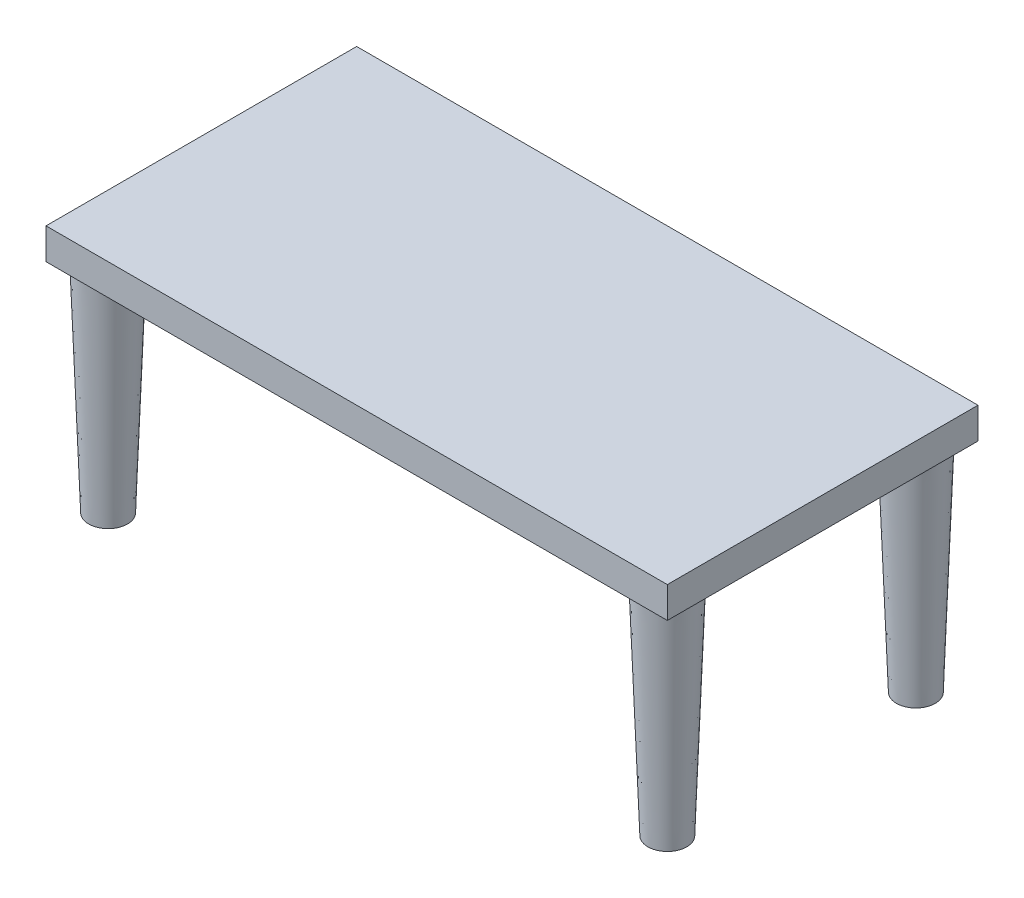
ISO-10303-21;
HEADER;
FILE_DESCRIPTION(('STEP AP214'),'2;1');
FILE_NAME('part.step','',(''),(''),'','','');
FILE_SCHEMA(('AUTOMOTIVE_DESIGN { 1 0 10303 214 1 1 1 1 }'));
ENDSEC;
DATA;
#1=APPLICATION_CONTEXT('core data for automotive mechanical design processes');
#2=APPLICATION_PROTOCOL_DEFINITION('international standard','automotive_design',2000,#1);
#3=PRODUCT_CONTEXT('',#1,'mechanical');
#4=PRODUCT('Part','Part','',(#3));
#5=PRODUCT_RELATED_PRODUCT_CATEGORY('part','',(#4));
#6=PRODUCT_DEFINITION_FORMATION('','',#4);
#7=PRODUCT_DEFINITION_CONTEXT('part definition',#1,'design');
#8=PRODUCT_DEFINITION('design','',#6,#7);
#9=PRODUCT_DEFINITION_SHAPE('','',#8);
#10=(LENGTH_UNIT() NAMED_UNIT(*) SI_UNIT(.MILLI.,.METRE.));
#11=(NAMED_UNIT(*) PLANE_ANGLE_UNIT() SI_UNIT($,.RADIAN.));
#12=(NAMED_UNIT(*) SI_UNIT($,.STERADIAN.) SOLID_ANGLE_UNIT());
#13=UNCERTAINTY_MEASURE_WITH_UNIT(LENGTH_MEASURE(1.E-05),#10,'distance_accuracy_value','');
#14=(GEOMETRIC_REPRESENTATION_CONTEXT(3) GLOBAL_UNCERTAINTY_ASSIGNED_CONTEXT((#13)) GLOBAL_UNIT_ASSIGNED_CONTEXT((#10,
#11,#12)) REPRESENTATION_CONTEXT('',''));
#15=CARTESIAN_POINT('',(0.,0.,0.));
#16=DIRECTION('',(0.,0.,1.));
#17=DIRECTION('',(1.,0.,0.));
#18=AXIS2_PLACEMENT_3D('',#15,#16,#17);
#19=CARTESIAN_POINT('',(100.,5.,-50.));
#20=DIRECTION('',(-1.,0.,0.));
#21=DIRECTION('',(0.,0.,1.));
#22=AXIS2_PLACEMENT_3D('',#19,#20,#21);
#23=PLANE('',#22);
#24=DIRECTION('',(0.,0.,-1.));
#25=VECTOR('',#24,1.);
#26=CARTESIAN_POINT('',(100.,-5.,-50.));
#27=LINE('',#26,#25);
#28=CARTESIAN_POINT('',(100.,-5.,50.));
#29=VERTEX_POINT('',#28);
#30=CARTESIAN_POINT('',(100.,-5.,-50.));
#31=VERTEX_POINT('',#30);
#32=EDGE_CURVE('E108',#29,#31,#27,.T.);
#33=ORIENTED_EDGE('',*,*,#32,.T.);
#34=DIRECTION('',(0.,-1.,0.));
#35=VECTOR('',#34,1.);
#36=CARTESIAN_POINT('',(100.,5.,-50.));
#37=LINE('',#36,#35);
#38=CARTESIAN_POINT('',(100.,5.,-50.));
#39=VERTEX_POINT('',#38);
#40=EDGE_CURVE('E12',#39,#31,#37,.T.);
#41=ORIENTED_EDGE('',*,*,#40,.F.);
#42=DIRECTION('',(0.,0.,-1.));
#43=VECTOR('',#42,1.);
#44=CARTESIAN_POINT('',(100.,5.,-50.));
#45=LINE('',#44,#43);
#46=CARTESIAN_POINT('',(100.,5.,50.));
#47=VERTEX_POINT('',#46);
#48=EDGE_CURVE('E96',#47,#39,#45,.T.);
#49=ORIENTED_EDGE('',*,*,#48,.F.);
#50=DIRECTION('',(0.,-1.,0.));
#51=VECTOR('',#50,1.);
#52=CARTESIAN_POINT('',(100.,5.,50.));
#53=LINE('',#52,#51);
#54=EDGE_CURVE('E104',#47,#29,#53,.T.);
#55=ORIENTED_EDGE('',*,*,#54,.T.);
#56=EDGE_LOOP('',(#33,#41,#49,#55));
#57=FACE_BOUND('',#56,.T.);
#58=ADVANCED_FACE('F45',(#57),#23,.F.);
#59=CARTESIAN_POINT('',(-100.,5.,-50.));
#60=DIRECTION('',(0.,0.,1.));
#61=DIRECTION('',(1.,0.,0.));
#62=AXIS2_PLACEMENT_3D('',#59,#60,#61);
#63=PLANE('',#62);
#64=DIRECTION('',(-1.,0.,0.));
#65=VECTOR('',#64,1.);
#66=CARTESIAN_POINT('',(-100.,-5.,-50.));
#67=LINE('',#66,#65);
#68=CARTESIAN_POINT('',(-100.,-5.,-50.));
#69=VERTEX_POINT('',#68);
#70=EDGE_CURVE('E100',#31,#69,#67,.T.);
#71=ORIENTED_EDGE('',*,*,#70,.T.);
#72=DIRECTION('',(0.,-1.,0.));
#73=VECTOR('',#72,1.);
#74=CARTESIAN_POINT('',(-100.,5.,-50.));
#75=LINE('',#74,#73);
#76=CARTESIAN_POINT('',(-100.,5.,-50.));
#77=VERTEX_POINT('',#76);
#78=EDGE_CURVE('E53',#77,#69,#75,.T.);
#79=ORIENTED_EDGE('',*,*,#78,.F.);
#80=DIRECTION('',(-1.,0.,0.));
#81=VECTOR('',#80,1.);
#82=CARTESIAN_POINT('',(-100.,5.,-50.));
#83=LINE('',#82,#81);
#84=EDGE_CURVE('E91',#39,#77,#83,.T.);
#85=ORIENTED_EDGE('',*,*,#84,.F.);
#86=ORIENTED_EDGE('',*,*,#40,.T.);
#87=EDGE_LOOP('',(#71,#79,#85,#86));
#88=FACE_BOUND('',#87,.T.);
#89=ADVANCED_FACE('F99',(#88),#63,.F.);
#90=CARTESIAN_POINT('',(-100.,5.,-50.));
#91=DIRECTION('',(1.,0.,0.));
#92=DIRECTION('',(0.,0.,-1.));
#93=AXIS2_PLACEMENT_3D('',#90,#91,#92);
#94=PLANE('',#93);
#95=DIRECTION('',(0.,0.,1.));
#96=VECTOR('',#95,1.);
#97=CARTESIAN_POINT('',(-100.,-5.,-50.));
#98=LINE('',#97,#96);
#99=CARTESIAN_POINT('',(-100.,-5.,50.));
#100=VERTEX_POINT('',#99);
#101=EDGE_CURVE('E78',#69,#100,#98,.T.);
#102=ORIENTED_EDGE('',*,*,#101,.T.);
#103=DIRECTION('',(0.,-1.,0.));
#104=VECTOR('',#103,1.);
#105=CARTESIAN_POINT('',(-100.,5.,50.));
#106=LINE('',#105,#104);
#107=CARTESIAN_POINT('',(-100.,5.,50.));
#108=VERTEX_POINT('',#107);
#109=EDGE_CURVE('E101',#108,#100,#106,.T.);
#110=ORIENTED_EDGE('',*,*,#109,.F.);
#111=DIRECTION('',(0.,0.,1.));
#112=VECTOR('',#111,1.);
#113=CARTESIAN_POINT('',(-100.,5.,-50.));
#114=LINE('',#113,#112);
#115=EDGE_CURVE('E94',#77,#108,#114,.T.);
#116=ORIENTED_EDGE('',*,*,#115,.F.);
#117=ORIENTED_EDGE('',*,*,#78,.T.);
#118=EDGE_LOOP('',(#102,#110,#116,#117));
#119=FACE_BOUND('',#118,.T.);
#120=ADVANCED_FACE('F102',(#119),#94,.F.);
#121=CARTESIAN_POINT('',(-100.,5.,50.));
#122=DIRECTION('',(0.,0.,-1.));
#123=DIRECTION('',(-1.,0.,0.));
#124=AXIS2_PLACEMENT_3D('',#121,#122,#123);
#125=PLANE('',#124);
#126=DIRECTION('',(1.,0.,0.));
#127=VECTOR('',#126,1.);
#128=CARTESIAN_POINT('',(-100.,-5.,50.));
#129=LINE('',#128,#127);
#130=EDGE_CURVE('E84',#100,#29,#129,.T.);
#131=ORIENTED_EDGE('',*,*,#130,.T.);
#132=ORIENTED_EDGE('',*,*,#54,.F.);
#133=DIRECTION('',(1.,0.,0.));
#134=VECTOR('',#133,1.);
#135=CARTESIAN_POINT('',(-100.,5.,50.));
#136=LINE('',#135,#134);
#137=EDGE_CURVE('E61',#108,#47,#136,.T.);
#138=ORIENTED_EDGE('',*,*,#137,.F.);
#139=ORIENTED_EDGE('',*,*,#109,.T.);
#140=EDGE_LOOP('',(#131,#132,#138,#139));
#141=FACE_BOUND('',#140,.T.);
#142=ADVANCED_FACE('F116',(#141),#125,.F.);
#143=CARTESIAN_POINT('',(0.,5.,0.));
#144=DIRECTION('',(0.,1.,0.));
#145=DIRECTION('',(0.,0.,1.));
#146=AXIS2_PLACEMENT_3D('',#143,#144,#145);
#147=PLANE('',#146);
#148=ORIENTED_EDGE('',*,*,#48,.T.);
#149=ORIENTED_EDGE('',*,*,#84,.T.);
#150=ORIENTED_EDGE('',*,*,#115,.T.);
#151=ORIENTED_EDGE('',*,*,#137,.T.);
#152=EDGE_LOOP('',(#148,#149,#150,#151));
#153=FACE_BOUND('',#152,.T.);
#154=ADVANCED_FACE('F92',(#153),#147,.T.);
#155=CARTESIAN_POINT('',(0.,-5.,0.));
#156=DIRECTION('',(0.,1.,0.));
#157=DIRECTION('',(0.,0.,1.));
#158=AXIS2_PLACEMENT_3D('',#155,#156,#157);
#159=PLANE('',#158);
#160=CARTESIAN_POINT('',(90.,-5.,-40.));
#161=DIRECTION('',(0.,-1.,0.));
#162=DIRECTION('',(0.,0.,-1.));
#163=AXIS2_PLACEMENT_3D('',#160,#161,#162);
#164=CIRCLE('',#163,8.75000000000001);
#165=CARTESIAN_POINT('',(90.,-5.,-48.75));
#166=VERTEX_POINT('',#165);
#167=EDGE_CURVE('E276',#166,#166,#164,.T.);
#168=ORIENTED_EDGE('',*,*,#167,.F.);
#169=EDGE_LOOP('',(#168));
#170=FACE_BOUND('',#169,.T.);
#171=CARTESIAN_POINT('',(90.,-5.,40.));
#172=DIRECTION('',(0.,-1.,0.));
#173=DIRECTION('',(0.,0.,-1.));
#174=AXIS2_PLACEMENT_3D('',#171,#172,#173);
#175=CIRCLE('',#174,8.75000000000001);
#176=CARTESIAN_POINT('',(90.,-5.,31.25));
#177=VERTEX_POINT('',#176);
#178=EDGE_CURVE('E295',#177,#177,#175,.T.);
#179=ORIENTED_EDGE('',*,*,#178,.F.);
#180=EDGE_LOOP('',(#179));
#181=FACE_BOUND('',#180,.T.);
#182=CARTESIAN_POINT('',(-90.,-5.,40.));
#183=DIRECTION('',(0.,-1.,0.));
#184=DIRECTION('',(0.,0.,-1.));
#185=AXIS2_PLACEMENT_3D('',#182,#183,#184);
#186=CIRCLE('',#185,8.75000000000001);
#187=CARTESIAN_POINT('',(-90.,-5.,31.25));
#188=VERTEX_POINT('',#187);
#189=EDGE_CURVE('E325',#188,#188,#186,.T.);
#190=ORIENTED_EDGE('',*,*,#189,.F.);
#191=EDGE_LOOP('',(#190));
#192=FACE_BOUND('',#191,.T.);
#193=CARTESIAN_POINT('',(-90.,-5.,-40.));
#194=DIRECTION('',(0.,-1.,0.));
#195=DIRECTION('',(0.,0.,-1.));
#196=AXIS2_PLACEMENT_3D('',#193,#194,#195);
#197=CIRCLE('',#196,8.75000000000001);
#198=CARTESIAN_POINT('',(-90.,-5.,-48.75));
#199=VERTEX_POINT('',#198);
#200=EDGE_CURVE('E126',#199,#199,#197,.T.);
#201=ORIENTED_EDGE('',*,*,#200,.F.);
#202=EDGE_LOOP('',(#201));
#203=FACE_BOUND('',#202,.T.);
#204=ORIENTED_EDGE('',*,*,#32,.F.);
#205=ORIENTED_EDGE('',*,*,#130,.F.);
#206=ORIENTED_EDGE('',*,*,#101,.F.);
#207=ORIENTED_EDGE('',*,*,#70,.F.);
#208=EDGE_LOOP('',(#204,#205,#206,#207));
#209=FACE_BOUND('',#208,.T.);
#210=ADVANCED_FACE('F119',(#170,#181,#192,#203,#209),#159,.F.);
#211=CARTESIAN_POINT('',(-90.,-75.,-40.));
#212=DIRECTION('',(0.,1.,0.));
#213=DIRECTION('',(0.,0.,1.));
#214=AXIS2_PLACEMENT_3D('',#211,#212,#213);
#215=PLANE('',#214);
#216=CARTESIAN_POINT('',(-90.,-75.,-40.));
#217=DIRECTION('',(0.,1.,0.));
#218=DIRECTION('',(0.,0.,1.));
#219=AXIS2_PLACEMENT_3D('',#216,#217,#218);
#220=CIRCLE('',#219,6.25);
#221=CARTESIAN_POINT('',(-90.,-75.,-33.75));
#222=VERTEX_POINT('',#221);
#223=EDGE_CURVE('E111',#222,#222,#220,.T.);
#224=ORIENTED_EDGE('',*,*,#223,.F.);
#225=EDGE_LOOP('',(#224));
#226=FACE_BOUND('',#225,.T.);
#227=ADVANCED_FACE('F133',(#226),#215,.F.);
#228=CARTESIAN_POINT('',(-90.,-75.,-40.));
#229=DIRECTION('',(0.,1.,0.));
#230=DIRECTION('',(0.,0.,1.));
#231=AXIS2_PLACEMENT_3D('',#228,#229,#230);
#232=CONICAL_SURFACE('',#231,6.25,0.0356991126793241);
#233=ORIENTED_EDGE('',*,*,#200,.T.);
#234=EDGE_LOOP('',(#233));
#235=FACE_BOUND('',#234,.T.);
#236=ORIENTED_EDGE('',*,*,#223,.T.);
#237=EDGE_LOOP('',(#236));
#238=FACE_BOUND('',#237,.T.);
#239=ADVANCED_FACE('F143',(#235,#238),#232,.T.);
#240=CARTESIAN_POINT('',(-90.,-75.,40.));
#241=DIRECTION('',(0.,1.,0.));
#242=DIRECTION('',(0.,0.,1.));
#243=AXIS2_PLACEMENT_3D('',#240,#241,#242);
#244=PLANE('',#243);
#245=CARTESIAN_POINT('',(-90.,-75.,40.));
#246=DIRECTION('',(0.,1.,0.));
#247=DIRECTION('',(0.,0.,1.));
#248=AXIS2_PLACEMENT_3D('',#245,#246,#247);
#249=CIRCLE('',#248,6.25);
#250=CARTESIAN_POINT('',(-90.,-75.,46.25));
#251=VERTEX_POINT('',#250);
#252=EDGE_CURVE('E332',#251,#251,#249,.T.);
#253=ORIENTED_EDGE('',*,*,#252,.F.);
#254=EDGE_LOOP('',(#253));
#255=FACE_BOUND('',#254,.T.);
#256=ADVANCED_FACE('F199',(#255),#244,.F.);
#257=CARTESIAN_POINT('',(-90.,-75.,40.));
#258=DIRECTION('',(0.,1.,0.));
#259=DIRECTION('',(0.,0.,1.));
#260=AXIS2_PLACEMENT_3D('',#257,#258,#259);
#261=CONICAL_SURFACE('',#260,6.25,0.0356991126793241);
#262=ORIENTED_EDGE('',*,*,#189,.T.);
#263=EDGE_LOOP('',(#262));
#264=FACE_BOUND('',#263,.T.);
#265=ORIENTED_EDGE('',*,*,#252,.T.);
#266=EDGE_LOOP('',(#265));
#267=FACE_BOUND('',#266,.T.);
#268=ADVANCED_FACE('F208',(#264,#267),#261,.T.);
#269=CARTESIAN_POINT('',(90.,-75.,40.));
#270=DIRECTION('',(0.,1.,0.));
#271=DIRECTION('',(0.,0.,1.));
#272=AXIS2_PLACEMENT_3D('',#269,#270,#271);
#273=PLANE('',#272);
#274=CARTESIAN_POINT('',(90.,-75.,40.));
#275=DIRECTION('',(0.,1.,0.));
#276=DIRECTION('',(0.,0.,1.));
#277=AXIS2_PLACEMENT_3D('',#274,#275,#276);
#278=CIRCLE('',#277,6.25);
#279=CARTESIAN_POINT('',(90.,-75.,46.25));
#280=VERTEX_POINT('',#279);
#281=EDGE_CURVE('E302',#280,#280,#278,.T.);
#282=ORIENTED_EDGE('',*,*,#281,.F.);
#283=EDGE_LOOP('',(#282));
#284=FACE_BOUND('',#283,.T.);
#285=ADVANCED_FACE('F217',(#284),#273,.F.);
#286=CARTESIAN_POINT('',(90.,-75.,40.));
#287=DIRECTION('',(0.,1.,0.));
#288=DIRECTION('',(0.,0.,1.));
#289=AXIS2_PLACEMENT_3D('',#286,#287,#288);
#290=CONICAL_SURFACE('',#289,6.25,0.0356991126793241);
#291=ORIENTED_EDGE('',*,*,#178,.T.);
#292=EDGE_LOOP('',(#291));
#293=FACE_BOUND('',#292,.T.);
#294=ORIENTED_EDGE('',*,*,#281,.T.);
#295=EDGE_LOOP('',(#294));
#296=FACE_BOUND('',#295,.T.);
#297=ADVANCED_FACE('F227',(#293,#296),#290,.T.);
#298=CARTESIAN_POINT('',(90.,-75.,-40.));
#299=DIRECTION('',(0.,1.,0.));
#300=DIRECTION('',(0.,0.,1.));
#301=AXIS2_PLACEMENT_3D('',#298,#299,#300);
#302=PLANE('',#301);
#303=CARTESIAN_POINT('',(90.,-75.,-40.));
#304=DIRECTION('',(0.,1.,0.));
#305=DIRECTION('',(0.,0.,1.));
#306=AXIS2_PLACEMENT_3D('',#303,#304,#305);
#307=CIRCLE('',#306,6.25);
#308=CARTESIAN_POINT('',(90.,-75.,-33.75));
#309=VERTEX_POINT('',#308);
#310=EDGE_CURVE('E283',#309,#309,#307,.T.);
#311=ORIENTED_EDGE('',*,*,#310,.F.);
#312=EDGE_LOOP('',(#311));
#313=FACE_BOUND('',#312,.T.);
#314=ADVANCED_FACE('F237',(#313),#302,.F.);
#315=CARTESIAN_POINT('',(90.,-75.,-40.));
#316=DIRECTION('',(0.,1.,0.));
#317=DIRECTION('',(0.,0.,1.));
#318=AXIS2_PLACEMENT_3D('',#315,#316,#317);
#319=CONICAL_SURFACE('',#318,6.25,0.0356991126793241);
#320=ORIENTED_EDGE('',*,*,#167,.T.);
#321=EDGE_LOOP('',(#320));
#322=FACE_BOUND('',#321,.T.);
#323=ORIENTED_EDGE('',*,*,#310,.T.);
#324=EDGE_LOOP('',(#323));
#325=FACE_BOUND('',#324,.T.);
#326=ADVANCED_FACE('F252',(#322,#325),#319,.T.);
#327=CLOSED_SHELL('',(#58,#89,#120,#142,#154,#210,#227,#239,#256,#268,#285,#297,#314,#326));
#328=MANIFOLD_SOLID_BREP('B2',#327);
#329=ADVANCED_BREP_SHAPE_REPRESENTATION('',(#18,#328),#14);
#330=SHAPE_DEFINITION_REPRESENTATION(#9,#329);
ENDSEC;
END-ISO-10303-21;
